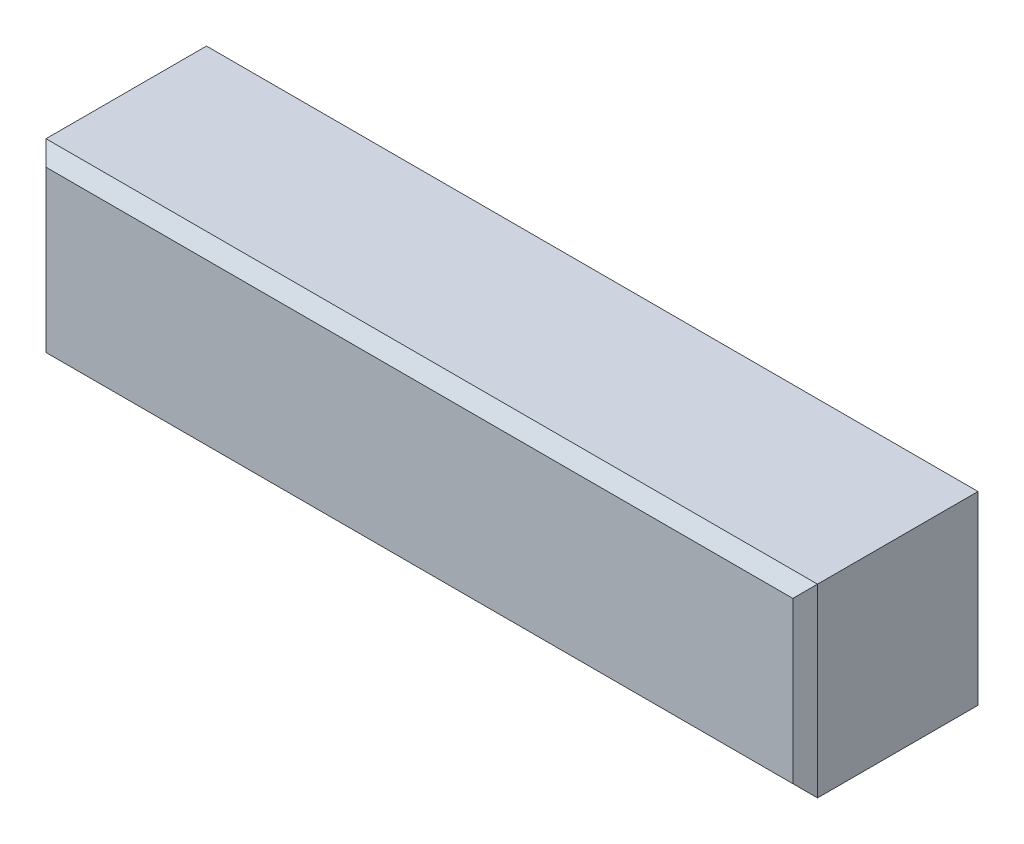
ISO-10303-21;
HEADER;
FILE_DESCRIPTION(('STEP AP214'),'2;1');
FILE_NAME('part.step','',(''),(''),'','','');
FILE_SCHEMA(('AUTOMOTIVE_DESIGN { 1 0 10303 214 1 1 1 1 }'));
ENDSEC;
DATA;
#1=APPLICATION_CONTEXT('core data for automotive mechanical design processes');
#2=APPLICATION_PROTOCOL_DEFINITION('international standard','automotive_design',2000,#1);
#3=PRODUCT_CONTEXT('',#1,'mechanical');
#4=PRODUCT('Part','Part','',(#3));
#5=PRODUCT_RELATED_PRODUCT_CATEGORY('part','',(#4));
#6=PRODUCT_DEFINITION_FORMATION('','',#4);
#7=PRODUCT_DEFINITION_CONTEXT('part definition',#1,'design');
#8=PRODUCT_DEFINITION('design','',#6,#7);
#9=PRODUCT_DEFINITION_SHAPE('','',#8);
#10=(LENGTH_UNIT() NAMED_UNIT(*) SI_UNIT(.MILLI.,.METRE.));
#11=(NAMED_UNIT(*) PLANE_ANGLE_UNIT() SI_UNIT($,.RADIAN.));
#12=(NAMED_UNIT(*) SI_UNIT($,.STERADIAN.) SOLID_ANGLE_UNIT());
#13=UNCERTAINTY_MEASURE_WITH_UNIT(LENGTH_MEASURE(1.E-05),#10,'distance_accuracy_value','');
#14=(GEOMETRIC_REPRESENTATION_CONTEXT(3) GLOBAL_UNCERTAINTY_ASSIGNED_CONTEXT((#13)) GLOBAL_UNIT_ASSIGNED_CONTEXT((#10,
#11,#12)) REPRESENTATION_CONTEXT('',''));
#15=CARTESIAN_POINT('',(0.,0.,0.));
#16=DIRECTION('',(0.,0.,1.));
#17=DIRECTION('',(1.,0.,0.));
#18=AXIS2_PLACEMENT_3D('',#15,#16,#17);
#19=CARTESIAN_POINT('',(25.,-2.59999999999924,5.99999999999999));
#20=DIRECTION('',(0.,0.707106781186548,-0.707106781186547));
#21=DIRECTION('',(0.,0.707106781186547,0.707106781186548));
#22=AXIS2_PLACEMENT_3D('',#19,#20,#21);
#23=PLANE('',#22);
#24=DIRECTION('',(0.577350269189626,0.577350269189626,0.577350269189626));
#25=VECTOR('',#24,1.);
#26=CARTESIAN_POINT('',(8.59999999999991,5.60000000000048,14.2));
#27=LINE('',#26,#25);
#28=CARTESIAN_POINT('',(0.,-2.99999999999948,5.60000000000001));
#29=VERTEX_POINT('',#28);
#30=CARTESIAN_POINT('',(0.399999999999956,-2.59999999999949,6.));
#31=VERTEX_POINT('',#30);
#32=EDGE_CURVE('E82',#29,#31,#27,.T.);
#33=ORIENTED_EDGE('',*,*,#32,.F.);
#34=DIRECTION('',(-1.,0.,0.));
#35=VECTOR('',#34,1.);
#36=CARTESIAN_POINT('',(24.9999999999999,-2.99999999999925,5.60000000000003));
#37=LINE('',#36,#35);
#38=CARTESIAN_POINT('',(24.9999999999999,-2.99999999999925,5.60000000000003));
#39=VERTEX_POINT('',#38);
#40=EDGE_CURVE('E95',#39,#29,#37,.T.);
#41=ORIENTED_EDGE('',*,*,#40,.F.);
#42=DIRECTION('',(0.577350269189626,-0.577350269189626,-0.577350269189626));
#43=VECTOR('',#42,1.);
#44=CARTESIAN_POINT('',(24.7333333333333,-2.73333333333262,5.86666666666664));
#45=LINE('',#44,#43);
#46=CARTESIAN_POINT('',(24.5999999999999,-2.59999999999924,5.99999999999999));
#47=VERTEX_POINT('',#46);
#48=EDGE_CURVE('E172',#47,#39,#45,.T.);
#49=ORIENTED_EDGE('',*,*,#48,.F.);
#50=DIRECTION('',(-1.,0.,0.));
#51=VECTOR('',#50,1.);
#52=CARTESIAN_POINT('',(25.,-2.59999999999924,5.99999999999999));
#53=LINE('',#52,#51);
#54=EDGE_CURVE('E98',#47,#31,#53,.T.);
#55=ORIENTED_EDGE('',*,*,#54,.T.);
#56=EDGE_LOOP('',(#33,#41,#49,#55));
#57=FACE_BOUND('',#56,.T.);
#58=ADVANCED_FACE('F16',(#57),#23,.F.);
#59=CARTESIAN_POINT('',(25.,2.60000000000057,6.));
#60=DIRECTION('',(0.,0.,-0.999999999999999));
#61=DIRECTION('',(-1.,0.,0.));
#62=AXIS2_PLACEMENT_3D('',#59,#60,#61);
#63=PLANE('',#62);
#64=DIRECTION('',(0.,1.,0.));
#65=VECTOR('',#64,1.);
#66=CARTESIAN_POINT('',(0.400000000000039,2.60000000000057,6.00000000000001));
#67=LINE('',#66,#65);
#68=CARTESIAN_POINT('',(0.400000000000039,2.60000000000057,6.00000000000001));
#69=VERTEX_POINT('',#68);
#70=EDGE_CURVE('E101',#31,#69,#67,.T.);
#71=ORIENTED_EDGE('',*,*,#70,.F.);
#72=ORIENTED_EDGE('',*,*,#54,.F.);
#73=DIRECTION('',(0.,-1.,0.));
#74=VECTOR('',#73,1.);
#75=CARTESIAN_POINT('',(24.6,2.6000000000008,5.99999999999997));
#76=LINE('',#75,#74);
#77=CARTESIAN_POINT('',(24.6,2.6000000000008,5.99999999999997));
#78=VERTEX_POINT('',#77);
#79=EDGE_CURVE('E100',#78,#47,#76,.T.);
#80=ORIENTED_EDGE('',*,*,#79,.F.);
#81=DIRECTION('',(-1.,0.,0.));
#82=VECTOR('',#81,1.);
#83=CARTESIAN_POINT('',(25.,2.60000000000057,6.));
#84=LINE('',#83,#82);
#85=EDGE_CURVE('E142',#78,#69,#84,.T.);
#86=ORIENTED_EDGE('',*,*,#85,.T.);
#87=EDGE_LOOP('',(#71,#72,#80,#86));
#88=FACE_BOUND('',#87,.T.);
#89=ADVANCED_FACE('F170',(#88),#63,.F.);
#90=CARTESIAN_POINT('',(25.,3.00000000000075,5.60000000000001));
#91=DIRECTION('',(0.,-0.707106781186548,-0.707106781186548));
#92=DIRECTION('',(0.,0.707106781186548,-0.707106781186547));
#93=AXIS2_PLACEMENT_3D('',#90,#91,#92);
#94=PLANE('',#93);
#95=DIRECTION('',(-0.577350269189626,0.577350269189626,-0.577350269189625));
#96=VECTOR('',#95,1.);
#97=CARTESIAN_POINT('',(8.33333333333333,-5.33333333333277,13.9333333333333));
#98=LINE('',#97,#96);
#99=CARTESIAN_POINT('',(0.,3.00000000000056,5.59999999999999));
#100=VERTEX_POINT('',#99);
#101=EDGE_CURVE('E85',#69,#100,#98,.T.);
#102=ORIENTED_EDGE('',*,*,#101,.F.);
#103=ORIENTED_EDGE('',*,*,#85,.F.);
#104=DIRECTION('',(-0.577350269189626,-0.577350269189626,0.577350269189626));
#105=VECTOR('',#104,1.);
#106=CARTESIAN_POINT('',(25.,3.00000000000075,5.60000000000001));
#107=LINE('',#106,#105);
#108=CARTESIAN_POINT('',(25.,3.00000000000075,5.60000000000001));
#109=VERTEX_POINT('',#108);
#110=EDGE_CURVE('E25',#109,#78,#107,.T.);
#111=ORIENTED_EDGE('',*,*,#110,.F.);
#112=DIRECTION('',(-1.,0.,0.));
#113=VECTOR('',#112,1.);
#114=CARTESIAN_POINT('',(25.,3.00000000000075,5.60000000000001));
#115=LINE('',#114,#113);
#116=EDGE_CURVE('E146',#109,#100,#115,.T.);
#117=ORIENTED_EDGE('',*,*,#116,.T.);
#118=EDGE_LOOP('',(#102,#103,#111,#117));
#119=FACE_BOUND('',#118,.T.);
#120=ADVANCED_FACE('F174',(#119),#94,.F.);
#121=CARTESIAN_POINT('',(0.,-5.59999999999938,3.00000000000002));
#122=DIRECTION('',(1.,0.,0.));
#123=DIRECTION('',(0.,1.,0.));
#124=AXIS2_PLACEMENT_3D('',#121,#122,#123);
#125=PLANE('',#124);
#126=DIRECTION('',(0.,-1.,0.));
#127=VECTOR('',#126,1.);
#128=CARTESIAN_POINT('',(-1.11022302462516E-13,-5.59999999999941,5.60000000000004));
#129=LINE('',#128,#127);
#130=EDGE_CURVE('E11',#100,#29,#129,.T.);
#131=ORIENTED_EDGE('',*,*,#130,.F.);
#132=DIRECTION('',(0.,0.,0.999999999999999));
#133=VECTOR('',#132,1.);
#134=CARTESIAN_POINT('',(0.,3.00000000000009,0.400000000000018));
#135=LINE('',#134,#133);
#136=CARTESIAN_POINT('',(0.,3.00000000000009,0.400000000000018));
#137=VERTEX_POINT('',#136);
#138=EDGE_CURVE('E118',#137,#100,#135,.T.);
#139=ORIENTED_EDGE('',*,*,#138,.F.);
#140=DIRECTION('',(0.,-1.,0.));
#141=VECTOR('',#140,1.);
#142=CARTESIAN_POINT('',(0.,-5.60000000000005,0.400000000000053));
#143=LINE('',#142,#141);
#144=CARTESIAN_POINT('',(0.,-3.00000000000014,0.400000000000032));
#145=VERTEX_POINT('',#144);
#146=EDGE_CURVE('E115',#137,#145,#143,.T.);
#147=ORIENTED_EDGE('',*,*,#146,.T.);
#148=DIRECTION('',(0.,0.,-0.999999999999999));
#149=VECTOR('',#148,1.);
#150=CARTESIAN_POINT('',(0.,-2.99999999999948,5.60000000000001));
#151=LINE('',#150,#149);
#152=EDGE_CURVE('E107',#29,#145,#151,.T.);
#153=ORIENTED_EDGE('',*,*,#152,.F.);
#154=EDGE_LOOP('',(#131,#139,#147,#153));
#155=FACE_BOUND('',#154,.T.);
#156=ADVANCED_FACE('F114',(#155),#125,.F.);
#157=CARTESIAN_POINT('',(24.9999999999999,-5.59999999999913,3.));
#158=DIRECTION('',(1.,0.,0.));
#159=DIRECTION('',(0.,1.,0.));
#160=AXIS2_PLACEMENT_3D('',#157,#158,#159);
#161=PLANE('',#160);
#162=DIRECTION('',(0.,0.,0.999999999999999));
#163=VECTOR('',#162,1.);
#164=CARTESIAN_POINT('',(25.,3.00000000000034,0.399999999999998));
#165=LINE('',#164,#163);
#166=CARTESIAN_POINT('',(25.,3.00000000000034,0.399999999999998));
#167=VERTEX_POINT('',#166);
#168=EDGE_CURVE('E131',#167,#109,#165,.T.);
#169=ORIENTED_EDGE('',*,*,#168,.T.);
#170=DIRECTION('',(0.,-1.,0.));
#171=VECTOR('',#170,1.);
#172=CARTESIAN_POINT('',(24.9999999999999,-5.59999999999941,5.60000000000005));
#173=LINE('',#172,#171);
#174=EDGE_CURVE('E32',#109,#39,#173,.T.);
#175=ORIENTED_EDGE('',*,*,#174,.T.);
#176=DIRECTION('',(0.,0.,-0.999999999999999));
#177=VECTOR('',#176,1.);
#178=CARTESIAN_POINT('',(24.9999999999999,-2.99999999999925,5.60000000000003));
#179=LINE('',#178,#177);
#180=CARTESIAN_POINT('',(24.9999999999999,-2.99999999999945,0.400000000000032));
#181=VERTEX_POINT('',#180);
#182=EDGE_CURVE('E109',#39,#181,#179,.T.);
#183=ORIENTED_EDGE('',*,*,#182,.T.);
#184=DIRECTION('',(0.,1.,0.));
#185=VECTOR('',#184,1.);
#186=CARTESIAN_POINT('',(25.,-5.59999999999941,0.400000000000046));
#187=LINE('',#186,#185);
#188=EDGE_CURVE('E160',#181,#167,#187,.T.);
#189=ORIENTED_EDGE('',*,*,#188,.T.);
#190=EDGE_LOOP('',(#169,#175,#183,#189));
#191=FACE_BOUND('',#190,.T.);
#192=ADVANCED_FACE('F208',(#191),#161,.T.);
#193=CARTESIAN_POINT('',(24.9999999999999,-2.59999999999952,0.));
#194=DIRECTION('',(0.,-0.707106781186548,-0.707106781186548));
#195=DIRECTION('',(0.,0.707106781186548,-0.707106781186547));
#196=AXIS2_PLACEMENT_3D('',#193,#194,#195);
#197=PLANE('',#196);
#198=DIRECTION('',(-1.,0.,0.));
#199=VECTOR('',#198,1.);
#200=CARTESIAN_POINT('',(24.9999999999999,-2.59999999999952,0.));
#201=LINE('',#200,#199);
#202=CARTESIAN_POINT('',(24.5999999999999,-2.59999999999952,0.));
#203=VERTEX_POINT('',#202);
#204=CARTESIAN_POINT('',(0.399999999999928,-2.59999999999996,0.));
#205=VERTEX_POINT('',#204);
#206=EDGE_CURVE('E135',#203,#205,#201,.T.);
#207=ORIENTED_EDGE('',*,*,#206,.F.);
#208=DIRECTION('',(0.577350269189626,-0.577350269189626,0.577350269189625));
#209=VECTOR('',#208,1.);
#210=CARTESIAN_POINT('',(24.7333333333333,-2.73333333333284,0.133333333333312));
#211=LINE('',#210,#209);
#212=EDGE_CURVE('E187',#203,#181,#211,.T.);
#213=ORIENTED_EDGE('',*,*,#212,.T.);
#214=DIRECTION('',(-1.,0.,0.));
#215=VECTOR('',#214,1.);
#216=CARTESIAN_POINT('',(24.9999999999999,-2.99999999999945,0.400000000000032));
#217=LINE('',#216,#215);
#218=EDGE_CURVE('E111',#181,#145,#217,.T.);
#219=ORIENTED_EDGE('',*,*,#218,.T.);
#220=DIRECTION('',(-0.577350269189626,-0.577350269189626,0.577350269189626));
#221=VECTOR('',#220,1.);
#222=CARTESIAN_POINT('',(8.59999999999983,5.60000000000069,-8.19999999999999));
#223=LINE('',#222,#221);
#224=EDGE_CURVE('E128',#205,#145,#223,.T.);
#225=ORIENTED_EDGE('',*,*,#224,.F.);
#226=EDGE_LOOP('',(#207,#213,#219,#225));
#227=FACE_BOUND('',#226,.T.);
#228=ADVANCED_FACE('F18',(#227),#197,.T.);
#229=CARTESIAN_POINT('',(25.,2.6000000000006,0.));
#230=DIRECTION('',(0.,-0.707106781186546,0.707106781186547));
#231=DIRECTION('',(0.,-0.707106781186548,-0.707106781186547));
#232=AXIS2_PLACEMENT_3D('',#229,#230,#231);
#233=PLANE('',#232);
#234=DIRECTION('',(0.577350269189626,0.577350269189626,0.577350269189626));
#235=VECTOR('',#234,1.);
#236=CARTESIAN_POINT('',(24.7333333333333,2.73333333333392,0.133333333333333));
#237=LINE('',#236,#235);
#238=CARTESIAN_POINT('',(24.6,2.6000000000006,0.));
#239=VERTEX_POINT('',#238);
#240=EDGE_CURVE('E40',#239,#167,#237,.T.);
#241=ORIENTED_EDGE('',*,*,#240,.F.);
#242=DIRECTION('',(-1.,0.,0.));
#243=VECTOR('',#242,1.);
#244=CARTESIAN_POINT('',(25.,2.6000000000006,0.));
#245=LINE('',#244,#243);
#246=CARTESIAN_POINT('',(0.400000000000011,2.59999999999994,0.));
#247=VERTEX_POINT('',#246);
#248=EDGE_CURVE('E153',#239,#247,#245,.T.);
#249=ORIENTED_EDGE('',*,*,#248,.T.);
#250=DIRECTION('',(-0.577350269189626,0.577350269189626,0.577350269189626));
#251=VECTOR('',#250,1.);
#252=CARTESIAN_POINT('',(8.59999999999997,-5.59999999999936,-8.19999999999996));
#253=LINE('',#252,#251);
#254=EDGE_CURVE('E194',#247,#137,#253,.T.);
#255=ORIENTED_EDGE('',*,*,#254,.T.);
#256=DIRECTION('',(-1.,0.,0.));
#257=VECTOR('',#256,1.);
#258=CARTESIAN_POINT('',(25.,3.00000000000034,0.399999999999998));
#259=LINE('',#258,#257);
#260=EDGE_CURVE('E149',#167,#137,#259,.T.);
#261=ORIENTED_EDGE('',*,*,#260,.F.);
#262=EDGE_LOOP('',(#241,#249,#255,#261));
#263=FACE_BOUND('',#262,.T.);
#264=ADVANCED_FACE('F214',(#263),#233,.F.);
#265=CARTESIAN_POINT('',(24.9999999999999,-2.59999999999952,0.));
#266=DIRECTION('',(0.,0.,0.999999999999999));
#267=DIRECTION('',(1.,0.,0.));
#268=AXIS2_PLACEMENT_3D('',#265,#266,#267);
#269=PLANE('',#268);
#270=DIRECTION('',(0.,1.,0.));
#271=VECTOR('',#270,1.);
#272=CARTESIAN_POINT('',(24.5999999999999,-2.59999999999952,0.));
#273=LINE('',#272,#271);
#274=EDGE_CURVE('E191',#203,#239,#273,.T.);
#275=ORIENTED_EDGE('',*,*,#274,.F.);
#276=ORIENTED_EDGE('',*,*,#206,.T.);
#277=DIRECTION('',(0.,1.,0.));
#278=VECTOR('',#277,1.);
#279=CARTESIAN_POINT('',(0.399999999999928,-2.59999999999996,0.));
#280=LINE('',#279,#278);
#281=EDGE_CURVE('E119',#205,#247,#280,.T.);
#282=ORIENTED_EDGE('',*,*,#281,.T.);
#283=ORIENTED_EDGE('',*,*,#248,.F.);
#284=EDGE_LOOP('',(#275,#276,#282,#283));
#285=FACE_BOUND('',#284,.T.);
#286=ADVANCED_FACE('F218',(#285),#269,.F.);
#287=CARTESIAN_POINT('',(24.9999999999999,-2.99999999999925,5.60000000000003));
#288=DIRECTION('',(0.,1.,0.));
#289=DIRECTION('',(-1.,0.,0.));
#290=AXIS2_PLACEMENT_3D('',#287,#288,#289);
#291=PLANE('',#290);
#292=ORIENTED_EDGE('',*,*,#152,.T.);
#293=ORIENTED_EDGE('',*,*,#218,.F.);
#294=ORIENTED_EDGE('',*,*,#182,.F.);
#295=ORIENTED_EDGE('',*,*,#40,.T.);
#296=EDGE_LOOP('',(#292,#293,#294,#295));
#297=FACE_BOUND('',#296,.T.);
#298=ADVANCED_FACE('F105',(#297),#291,.F.);
#299=CARTESIAN_POINT('',(25.,3.00000000000034,0.399999999999998));
#300=DIRECTION('',(0.,-1.,0.));
#301=DIRECTION('',(1.,0.,0.));
#302=AXIS2_PLACEMENT_3D('',#299,#300,#301);
#303=PLANE('',#302);
#304=ORIENTED_EDGE('',*,*,#138,.T.);
#305=ORIENTED_EDGE('',*,*,#116,.F.);
#306=ORIENTED_EDGE('',*,*,#168,.F.);
#307=ORIENTED_EDGE('',*,*,#260,.T.);
#308=EDGE_LOOP('',(#304,#305,#306,#307));
#309=FACE_BOUND('',#308,.T.);
#310=ADVANCED_FACE('F212',(#309),#303,.F.);
#311=CARTESIAN_POINT('',(0.439999999999996,2.99999999999989,-0.0399999999999984));
#312=DIRECTION('',(0.707106781186548,0.,0.707106781186547));
#313=DIRECTION('',(-0.707106781186548,0.,0.707106781186548));
#314=AXIS2_PLACEMENT_3D('',#311,#312,#313);
#315=PLANE('',#314);
#316=ORIENTED_EDGE('',*,*,#224,.T.);
#317=ORIENTED_EDGE('',*,*,#146,.F.);
#318=ORIENTED_EDGE('',*,*,#254,.F.);
#319=ORIENTED_EDGE('',*,*,#281,.F.);
#320=EDGE_LOOP('',(#316,#317,#318,#319));
#321=FACE_BOUND('',#320,.T.);
#322=ADVANCED_FACE('F203',(#321),#315,.F.);
#323=CARTESIAN_POINT('',(24.56,3.00000000000056,-0.0400000000000053));
#324=DIRECTION('',(0.707106781186547,0.,-0.707106781186548));
#325=DIRECTION('',(0.707106781186548,0.,0.707106781186546));
#326=AXIS2_PLACEMENT_3D('',#323,#324,#325);
#327=PLANE('',#326);
#328=ORIENTED_EDGE('',*,*,#274,.T.);
#329=ORIENTED_EDGE('',*,*,#240,.T.);
#330=ORIENTED_EDGE('',*,*,#188,.F.);
#331=ORIENTED_EDGE('',*,*,#212,.F.);
#332=EDGE_LOOP('',(#328,#329,#330,#331));
#333=FACE_BOUND('',#332,.T.);
#334=ADVANCED_FACE('F219',(#333),#327,.T.);
#335=CARTESIAN_POINT('',(25.04,3.00000000000078,5.56));
#336=DIRECTION('',(0.707106781186548,0.,0.707106781186547));
#337=DIRECTION('',(-0.707106781186548,0.,0.707106781186548));
#338=AXIS2_PLACEMENT_3D('',#335,#336,#337);
#339=PLANE('',#338);
#340=ORIENTED_EDGE('',*,*,#110,.T.);
#341=ORIENTED_EDGE('',*,*,#79,.T.);
#342=ORIENTED_EDGE('',*,*,#48,.T.);
#343=ORIENTED_EDGE('',*,*,#174,.F.);
#344=EDGE_LOOP('',(#340,#341,#342,#343));
#345=FACE_BOUND('',#344,.T.);
#346=ADVANCED_FACE('F165',(#345),#339,.T.);
#347=CARTESIAN_POINT('',(0.439999999999996,3.00000000000009,6.03999999999999));
#348=DIRECTION('',(-0.707106781186548,0.,0.707106781186547));
#349=DIRECTION('',(-0.707106781186547,0.,-0.707106781186547));
#350=AXIS2_PLACEMENT_3D('',#347,#348,#349);
#351=PLANE('',#350);
#352=ORIENTED_EDGE('',*,*,#32,.T.);
#353=ORIENTED_EDGE('',*,*,#70,.T.);
#354=ORIENTED_EDGE('',*,*,#101,.T.);
#355=ORIENTED_EDGE('',*,*,#130,.T.);
#356=EDGE_LOOP('',(#352,#353,#354,#355));
#357=FACE_BOUND('',#356,.T.);
#358=ADVANCED_FACE('F81',(#357),#351,.T.);
#359=CLOSED_SHELL('',(#58,#89,#120,#156,#192,#228,#264,#286,#298,#310,#322,#334,#346,#358));
#360=MANIFOLD_SOLID_BREP('B1',#359);
#361=ADVANCED_BREP_SHAPE_REPRESENTATION('',(#18,#360),#14);
#362=SHAPE_DEFINITION_REPRESENTATION(#9,#361);
ENDSEC;
END-ISO-10303-21;
